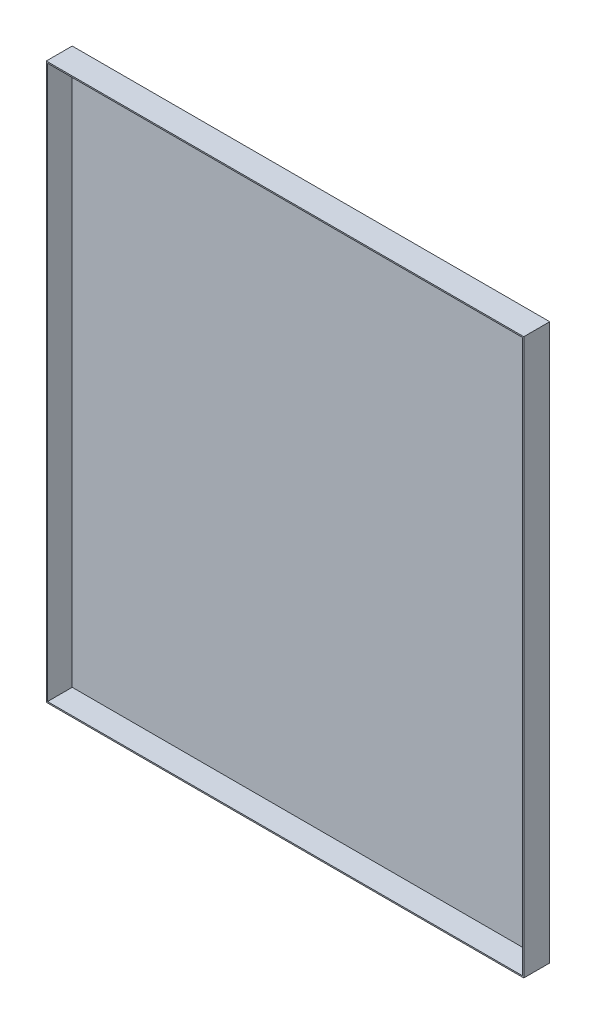
ISO-10303-21;
HEADER;
FILE_DESCRIPTION(('STEP AP214'),'2;1');
FILE_NAME('part.step','',(''),(''),'','','');
FILE_SCHEMA(('AUTOMOTIVE_DESIGN { 1 0 10303 214 1 1 1 1 }'));
ENDSEC;
DATA;
#1=APPLICATION_CONTEXT('core data for automotive mechanical design processes');
#2=APPLICATION_PROTOCOL_DEFINITION('international standard','automotive_design',2000,#1);
#3=PRODUCT_CONTEXT('',#1,'mechanical');
#4=PRODUCT('Part','Part','',(#3));
#5=PRODUCT_RELATED_PRODUCT_CATEGORY('part','',(#4));
#6=PRODUCT_DEFINITION_FORMATION('','',#4);
#7=PRODUCT_DEFINITION_CONTEXT('part definition',#1,'design');
#8=PRODUCT_DEFINITION('design','',#6,#7);
#9=PRODUCT_DEFINITION_SHAPE('','',#8);
#10=(LENGTH_UNIT() NAMED_UNIT(*) SI_UNIT(.MILLI.,.METRE.));
#11=(NAMED_UNIT(*) PLANE_ANGLE_UNIT() SI_UNIT($,.RADIAN.));
#12=(NAMED_UNIT(*) SI_UNIT($,.STERADIAN.) SOLID_ANGLE_UNIT());
#13=UNCERTAINTY_MEASURE_WITH_UNIT(LENGTH_MEASURE(1.E-05),#10,'distance_accuracy_value','');
#14=(GEOMETRIC_REPRESENTATION_CONTEXT(3) GLOBAL_UNCERTAINTY_ASSIGNED_CONTEXT((#13)) GLOBAL_UNIT_ASSIGNED_CONTEXT((#10,
#11,#12)) REPRESENTATION_CONTEXT('',''));
#15=CARTESIAN_POINT('',(0.,0.,0.));
#16=DIRECTION('',(0.,0.,1.));
#17=DIRECTION('',(1.,0.,0.));
#18=AXIS2_PLACEMENT_3D('',#15,#16,#17);
#19=CARTESIAN_POINT('',(184.,214.,20.));
#20=DIRECTION('',(-1.,0.,0.));
#21=DIRECTION('',(0.,-1.,0.));
#22=AXIS2_PLACEMENT_3D('',#19,#20,#21);
#23=PLANE('',#22);
#24=DIRECTION('',(0.,1.,0.));
#25=VECTOR('',#24,1.);
#26=CARTESIAN_POINT('',(184.,214.,0.));
#27=LINE('',#26,#25);
#28=CARTESIAN_POINT('',(184.,-214.,0.));
#29=VERTEX_POINT('',#28);
#30=CARTESIAN_POINT('',(184.,214.,0.));
#31=VERTEX_POINT('',#30);
#32=EDGE_CURVE('E167',#29,#31,#27,.T.);
#33=ORIENTED_EDGE('',*,*,#32,.T.);
#34=DIRECTION('',(0.,0.,-1.));
#35=VECTOR('',#34,1.);
#36=CARTESIAN_POINT('',(184.,214.,20.));
#37=LINE('',#36,#35);
#38=CARTESIAN_POINT('',(184.,214.,20.));
#39=VERTEX_POINT('',#38);
#40=EDGE_CURVE('E11',#39,#31,#37,.T.);
#41=ORIENTED_EDGE('',*,*,#40,.F.);
#42=DIRECTION('',(0.,1.,0.));
#43=VECTOR('',#42,1.);
#44=CARTESIAN_POINT('',(184.,214.,20.));
#45=LINE('',#44,#43);
#46=CARTESIAN_POINT('',(184.,-214.,20.));
#47=VERTEX_POINT('',#46);
#48=EDGE_CURVE('E156',#47,#39,#45,.T.);
#49=ORIENTED_EDGE('',*,*,#48,.F.);
#50=DIRECTION('',(0.,0.,-1.));
#51=VECTOR('',#50,1.);
#52=CARTESIAN_POINT('',(184.,-214.,20.));
#53=LINE('',#52,#51);
#54=EDGE_CURVE('E166',#47,#29,#53,.T.);
#55=ORIENTED_EDGE('',*,*,#54,.T.);
#56=EDGE_LOOP('',(#33,#41,#49,#55));
#57=FACE_BOUND('',#56,.T.);
#58=ADVANCED_FACE('F39',(#57),#23,.F.);
#59=CARTESIAN_POINT('',(-184.,214.,20.));
#60=DIRECTION('',(0.,-1.,0.));
#61=DIRECTION('',(0.,0.,-1.));
#62=AXIS2_PLACEMENT_3D('',#59,#60,#61);
#63=PLANE('',#62);
#64=DIRECTION('',(-1.,0.,0.));
#65=VECTOR('',#64,1.);
#66=CARTESIAN_POINT('',(-184.,214.,0.));
#67=LINE('',#66,#65);
#68=CARTESIAN_POINT('',(-184.,214.,0.));
#69=VERTEX_POINT('',#68);
#70=EDGE_CURVE('E171',#31,#69,#67,.T.);
#71=ORIENTED_EDGE('',*,*,#70,.T.);
#72=DIRECTION('',(0.,0.,-1.));
#73=VECTOR('',#72,1.);
#74=CARTESIAN_POINT('',(-184.,214.,20.));
#75=LINE('',#74,#73);
#76=CARTESIAN_POINT('',(-184.,214.,20.));
#77=VERTEX_POINT('',#76);
#78=EDGE_CURVE('E47',#77,#69,#75,.T.);
#79=ORIENTED_EDGE('',*,*,#78,.F.);
#80=DIRECTION('',(-1.,0.,0.));
#81=VECTOR('',#80,1.);
#82=CARTESIAN_POINT('',(-184.,214.,20.));
#83=LINE('',#82,#81);
#84=EDGE_CURVE('E91',#39,#77,#83,.T.);
#85=ORIENTED_EDGE('',*,*,#84,.F.);
#86=ORIENTED_EDGE('',*,*,#40,.T.);
#87=EDGE_LOOP('',(#71,#79,#85,#86));
#88=FACE_BOUND('',#87,.T.);
#89=ADVANCED_FACE('F206',(#88),#63,.F.);
#90=CARTESIAN_POINT('',(-184.,214.,20.));
#91=DIRECTION('',(1.,0.,0.));
#92=DIRECTION('',(0.,1.,0.));
#93=AXIS2_PLACEMENT_3D('',#90,#91,#92);
#94=PLANE('',#93);
#95=DIRECTION('',(0.,-1.,0.));
#96=VECTOR('',#95,1.);
#97=CARTESIAN_POINT('',(-184.,214.,0.));
#98=LINE('',#97,#96);
#99=CARTESIAN_POINT('',(-184.,-214.,0.));
#100=VERTEX_POINT('',#99);
#101=EDGE_CURVE('E174',#69,#100,#98,.T.);
#102=ORIENTED_EDGE('',*,*,#101,.T.);
#103=DIRECTION('',(0.,0.,-1.));
#104=VECTOR('',#103,1.);
#105=CARTESIAN_POINT('',(-184.,-214.,20.));
#106=LINE('',#105,#104);
#107=CARTESIAN_POINT('',(-184.,-214.,20.));
#108=VERTEX_POINT('',#107);
#109=EDGE_CURVE('E181',#108,#100,#106,.T.);
#110=ORIENTED_EDGE('',*,*,#109,.F.);
#111=DIRECTION('',(0.,-1.,0.));
#112=VECTOR('',#111,1.);
#113=CARTESIAN_POINT('',(-184.,214.,20.));
#114=LINE('',#113,#112);
#115=EDGE_CURVE('E161',#77,#108,#114,.T.);
#116=ORIENTED_EDGE('',*,*,#115,.F.);
#117=ORIENTED_EDGE('',*,*,#78,.T.);
#118=EDGE_LOOP('',(#102,#110,#116,#117));
#119=FACE_BOUND('',#118,.T.);
#120=ADVANCED_FACE('F188',(#119),#94,.F.);
#121=CARTESIAN_POINT('',(-184.,-214.,20.));
#122=DIRECTION('',(0.,1.,0.));
#123=DIRECTION('',(0.,0.,1.));
#124=AXIS2_PLACEMENT_3D('',#121,#122,#123);
#125=PLANE('',#124);
#126=DIRECTION('',(1.,0.,0.));
#127=VECTOR('',#126,1.);
#128=CARTESIAN_POINT('',(-184.,-214.,0.));
#129=LINE('',#128,#127);
#130=EDGE_CURVE('E84',#100,#29,#129,.T.);
#131=ORIENTED_EDGE('',*,*,#130,.T.);
#132=ORIENTED_EDGE('',*,*,#54,.F.);
#133=DIRECTION('',(1.,0.,0.));
#134=VECTOR('',#133,1.);
#135=CARTESIAN_POINT('',(-184.,-214.,20.));
#136=LINE('',#135,#134);
#137=EDGE_CURVE('E63',#108,#47,#136,.T.);
#138=ORIENTED_EDGE('',*,*,#137,.F.);
#139=ORIENTED_EDGE('',*,*,#109,.T.);
#140=EDGE_LOOP('',(#131,#132,#138,#139));
#141=FACE_BOUND('',#140,.T.);
#142=ADVANCED_FACE('F196',(#141),#125,.F.);
#143=CARTESIAN_POINT('',(0.,0.,20.));
#144=DIRECTION('',(0.,0.,1.));
#145=DIRECTION('',(1.,0.,0.));
#146=AXIS2_PLACEMENT_3D('',#143,#144,#145);
#147=PLANE('',#146);
#148=DIRECTION('',(0.,1.,0.));
#149=VECTOR('',#148,1.);
#150=CARTESIAN_POINT('',(183.,214.,20.));
#151=LINE('',#150,#149);
#152=CARTESIAN_POINT('',(183.,-213.,20.));
#153=VERTEX_POINT('',#152);
#154=CARTESIAN_POINT('',(183.,213.,20.));
#155=VERTEX_POINT('',#154);
#156=EDGE_CURVE('E140',#153,#155,#151,.T.);
#157=ORIENTED_EDGE('',*,*,#156,.F.);
#158=DIRECTION('',(1.,0.,0.));
#159=VECTOR('',#158,1.);
#160=CARTESIAN_POINT('',(-184.,-213.,20.));
#161=LINE('',#160,#159);
#162=CARTESIAN_POINT('',(-183.,-213.,20.));
#163=VERTEX_POINT('',#162);
#164=EDGE_CURVE('E153',#163,#153,#161,.T.);
#165=ORIENTED_EDGE('',*,*,#164,.F.);
#166=DIRECTION('',(0.,-1.,0.));
#167=VECTOR('',#166,1.);
#168=CARTESIAN_POINT('',(-183.,214.,20.));
#169=LINE('',#168,#167);
#170=CARTESIAN_POINT('',(-183.,213.,20.));
#171=VERTEX_POINT('',#170);
#172=EDGE_CURVE('E150',#171,#163,#169,.T.);
#173=ORIENTED_EDGE('',*,*,#172,.F.);
#174=DIRECTION('',(-1.,0.,0.));
#175=VECTOR('',#174,1.);
#176=CARTESIAN_POINT('',(-184.,213.,20.));
#177=LINE('',#176,#175);
#178=EDGE_CURVE('E129',#155,#171,#177,.T.);
#179=ORIENTED_EDGE('',*,*,#178,.F.);
#180=EDGE_LOOP('',(#157,#165,#173,#179));
#181=FACE_BOUND('',#180,.T.);
#182=ORIENTED_EDGE('',*,*,#48,.T.);
#183=ORIENTED_EDGE('',*,*,#84,.T.);
#184=ORIENTED_EDGE('',*,*,#115,.T.);
#185=ORIENTED_EDGE('',*,*,#137,.T.);
#186=EDGE_LOOP('',(#182,#183,#184,#185));
#187=FACE_BOUND('',#186,.T.);
#188=ADVANCED_FACE('F198',(#181,#187),#147,.T.);
#189=CARTESIAN_POINT('',(0.,0.,0.));
#190=DIRECTION('',(0.,0.,1.));
#191=DIRECTION('',(1.,0.,0.));
#192=AXIS2_PLACEMENT_3D('',#189,#190,#191);
#193=PLANE('',#192);
#194=ORIENTED_EDGE('',*,*,#32,.F.);
#195=ORIENTED_EDGE('',*,*,#130,.F.);
#196=ORIENTED_EDGE('',*,*,#101,.F.);
#197=ORIENTED_EDGE('',*,*,#70,.F.);
#198=EDGE_LOOP('',(#194,#195,#196,#197));
#199=FACE_BOUND('',#198,.T.);
#200=ADVANCED_FACE('F192',(#199),#193,.F.);
#201=CARTESIAN_POINT('',(183.,214.,20.));
#202=DIRECTION('',(-1.,0.,0.));
#203=DIRECTION('',(0.,-1.,0.));
#204=AXIS2_PLACEMENT_3D('',#201,#202,#203);
#205=PLANE('',#204);
#206=DIRECTION('',(0.,1.,0.));
#207=VECTOR('',#206,1.);
#208=CARTESIAN_POINT('',(183.,214.,1.));
#209=LINE('',#208,#207);
#210=CARTESIAN_POINT('',(183.,-213.,1.));
#211=VERTEX_POINT('',#210);
#212=CARTESIAN_POINT('',(183.,213.,1.));
#213=VERTEX_POINT('',#212);
#214=EDGE_CURVE('E119',#211,#213,#209,.T.);
#215=ORIENTED_EDGE('',*,*,#214,.F.);
#216=DIRECTION('',(0.,0.,-1.));
#217=VECTOR('',#216,1.);
#218=CARTESIAN_POINT('',(183.,-213.,20.));
#219=LINE('',#218,#217);
#220=EDGE_CURVE('E144',#153,#211,#219,.T.);
#221=ORIENTED_EDGE('',*,*,#220,.F.);
#222=ORIENTED_EDGE('',*,*,#156,.T.);
#223=DIRECTION('',(0.,0.,-1.));
#224=VECTOR('',#223,1.);
#225=CARTESIAN_POINT('',(183.,213.,20.));
#226=LINE('',#225,#224);
#227=EDGE_CURVE('E133',#155,#213,#226,.T.);
#228=ORIENTED_EDGE('',*,*,#227,.T.);
#229=EDGE_LOOP('',(#215,#221,#222,#228));
#230=FACE_BOUND('',#229,.T.);
#231=ADVANCED_FACE('F233',(#230),#205,.T.);
#232=CARTESIAN_POINT('',(-184.,213.,20.));
#233=DIRECTION('',(0.,-1.,0.));
#234=DIRECTION('',(0.,0.,-1.));
#235=AXIS2_PLACEMENT_3D('',#232,#233,#234);
#236=PLANE('',#235);
#237=DIRECTION('',(-1.,0.,0.));
#238=VECTOR('',#237,1.);
#239=CARTESIAN_POINT('',(-184.,213.,1.));
#240=LINE('',#239,#238);
#241=CARTESIAN_POINT('',(-183.,213.,1.));
#242=VERTEX_POINT('',#241);
#243=EDGE_CURVE('E113',#213,#242,#240,.T.);
#244=ORIENTED_EDGE('',*,*,#243,.F.);
#245=ORIENTED_EDGE('',*,*,#227,.F.);
#246=ORIENTED_EDGE('',*,*,#178,.T.);
#247=DIRECTION('',(0.,0.,-1.));
#248=VECTOR('',#247,1.);
#249=CARTESIAN_POINT('',(-183.,213.,20.));
#250=LINE('',#249,#248);
#251=EDGE_CURVE('E126',#171,#242,#250,.T.);
#252=ORIENTED_EDGE('',*,*,#251,.T.);
#253=EDGE_LOOP('',(#244,#245,#246,#252));
#254=FACE_BOUND('',#253,.T.);
#255=ADVANCED_FACE('F127',(#254),#236,.T.);
#256=CARTESIAN_POINT('',(-183.,214.,20.));
#257=DIRECTION('',(1.,0.,0.));
#258=DIRECTION('',(0.,1.,0.));
#259=AXIS2_PLACEMENT_3D('',#256,#257,#258);
#260=PLANE('',#259);
#261=DIRECTION('',(0.,-1.,0.));
#262=VECTOR('',#261,1.);
#263=CARTESIAN_POINT('',(-183.,214.,1.));
#264=LINE('',#263,#262);
#265=CARTESIAN_POINT('',(-183.,-213.,1.));
#266=VERTEX_POINT('',#265);
#267=EDGE_CURVE('E117',#242,#266,#264,.T.);
#268=ORIENTED_EDGE('',*,*,#267,.F.);
#269=ORIENTED_EDGE('',*,*,#251,.F.);
#270=ORIENTED_EDGE('',*,*,#172,.T.);
#271=DIRECTION('',(0.,0.,-1.));
#272=VECTOR('',#271,1.);
#273=CARTESIAN_POINT('',(-183.,-213.,20.));
#274=LINE('',#273,#272);
#275=EDGE_CURVE('E54',#163,#266,#274,.T.);
#276=ORIENTED_EDGE('',*,*,#275,.T.);
#277=EDGE_LOOP('',(#268,#269,#270,#276));
#278=FACE_BOUND('',#277,.T.);
#279=ADVANCED_FACE('F135',(#278),#260,.T.);
#280=CARTESIAN_POINT('',(-184.,-213.,20.));
#281=DIRECTION('',(0.,1.,0.));
#282=DIRECTION('',(0.,0.,1.));
#283=AXIS2_PLACEMENT_3D('',#280,#281,#282);
#284=PLANE('',#283);
#285=DIRECTION('',(1.,0.,0.));
#286=VECTOR('',#285,1.);
#287=CARTESIAN_POINT('',(-184.,-213.,1.));
#288=LINE('',#287,#286);
#289=EDGE_CURVE('E137',#266,#211,#288,.T.);
#290=ORIENTED_EDGE('',*,*,#289,.F.);
#291=ORIENTED_EDGE('',*,*,#275,.F.);
#292=ORIENTED_EDGE('',*,*,#164,.T.);
#293=ORIENTED_EDGE('',*,*,#220,.T.);
#294=EDGE_LOOP('',(#290,#291,#292,#293));
#295=FACE_BOUND('',#294,.T.);
#296=ADVANCED_FACE('F263',(#295),#284,.T.);
#297=CARTESIAN_POINT('',(0.,0.,1.));
#298=DIRECTION('',(0.,0.,1.));
#299=DIRECTION('',(1.,0.,0.));
#300=AXIS2_PLACEMENT_3D('',#297,#298,#299);
#301=PLANE('',#300);
#302=ORIENTED_EDGE('',*,*,#214,.T.);
#303=ORIENTED_EDGE('',*,*,#243,.T.);
#304=ORIENTED_EDGE('',*,*,#267,.T.);
#305=ORIENTED_EDGE('',*,*,#289,.T.);
#306=EDGE_LOOP('',(#302,#303,#304,#305));
#307=FACE_BOUND('',#306,.T.);
#308=ADVANCED_FACE('F115',(#307),#301,.T.);
#309=CLOSED_SHELL('',(#58,#89,#120,#142,#188,#200,#231,#255,#279,#296,#308));
#310=MANIFOLD_SOLID_BREP('B2',#309);
#311=ADVANCED_BREP_SHAPE_REPRESENTATION('',(#18,#310),#14);
#312=SHAPE_DEFINITION_REPRESENTATION(#9,#311);
ENDSEC;
END-ISO-10303-21;
